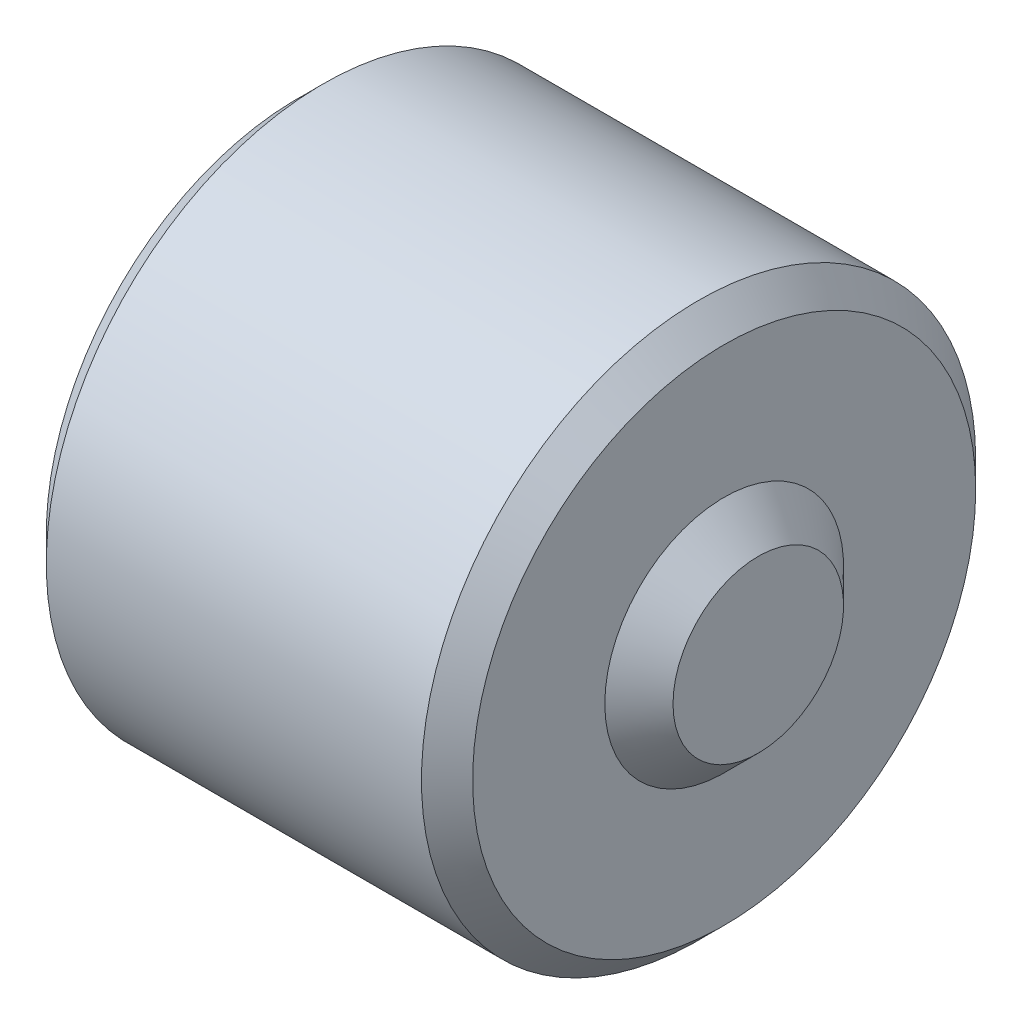
ISO-10303-21;
HEADER;
FILE_DESCRIPTION(('STEP AP214'),'2;1');
FILE_NAME('part.step','',(''),(''),'','','');
FILE_SCHEMA(('AUTOMOTIVE_DESIGN { 1 0 10303 214 1 1 1 1 }'));
ENDSEC;
DATA;
#1=APPLICATION_CONTEXT('core data for automotive mechanical design processes');
#2=APPLICATION_PROTOCOL_DEFINITION('international standard','automotive_design',2000,#1);
#3=PRODUCT_CONTEXT('',#1,'mechanical');
#4=PRODUCT('Part','Part','',(#3));
#5=PRODUCT_RELATED_PRODUCT_CATEGORY('part','',(#4));
#6=PRODUCT_DEFINITION_FORMATION('','',#4);
#7=PRODUCT_DEFINITION_CONTEXT('part definition',#1,'design');
#8=PRODUCT_DEFINITION('design','',#6,#7);
#9=PRODUCT_DEFINITION_SHAPE('','',#8);
#10=(LENGTH_UNIT() NAMED_UNIT(*) SI_UNIT(.MILLI.,.METRE.));
#11=(NAMED_UNIT(*) PLANE_ANGLE_UNIT() SI_UNIT($,.RADIAN.));
#12=(NAMED_UNIT(*) SI_UNIT($,.STERADIAN.) SOLID_ANGLE_UNIT());
#13=UNCERTAINTY_MEASURE_WITH_UNIT(LENGTH_MEASURE(1.E-05),#10,'distance_accuracy_value','');
#14=(GEOMETRIC_REPRESENTATION_CONTEXT(3) GLOBAL_UNCERTAINTY_ASSIGNED_CONTEXT((#13)) GLOBAL_UNIT_ASSIGNED_CONTEXT((#10,
#11,#12)) REPRESENTATION_CONTEXT('',''));
#15=CARTESIAN_POINT('',(0.,0.,0.));
#16=DIRECTION('',(0.,0.,1.));
#17=DIRECTION('',(1.,0.,0.));
#18=AXIS2_PLACEMENT_3D('',#15,#16,#17);
#19=CARTESIAN_POINT('',(-12.7,0.,0.));
#20=DIRECTION('',(1.,0.,0.));
#21=DIRECTION('',(0.,0.,-1.));
#22=AXIS2_PLACEMENT_3D('',#19,#20,#21);
#23=CYLINDRICAL_SURFACE('',#22,8.255);
#24=CARTESIAN_POINT('',(-11.938,0.,0.));
#25=DIRECTION('',(1.,0.,0.));
#26=DIRECTION('',(0.,0.,-1.));
#27=AXIS2_PLACEMENT_3D('',#24,#25,#26);
#28=CIRCLE('',#27,8.255);
#29=CARTESIAN_POINT('',(-11.938,0.,-8.255));
#30=VERTEX_POINT('',#29);
#31=EDGE_CURVE('E67',#30,#30,#28,.T.);
#32=ORIENTED_EDGE('',*,*,#31,.T.);
#33=EDGE_LOOP('',(#32));
#34=FACE_BOUND('',#33,.T.);
#35=CARTESIAN_POINT('',(-0.762000000000002,0.,0.));
#36=DIRECTION('',(1.,0.,0.));
#37=DIRECTION('',(0.,0.,-1.));
#38=AXIS2_PLACEMENT_3D('',#35,#36,#37);
#39=CIRCLE('',#38,8.255);
#40=CARTESIAN_POINT('',(-0.762000000000002,0.,-8.255));
#41=VERTEX_POINT('',#40);
#42=EDGE_CURVE('E73',#41,#41,#39,.F.);
#43=ORIENTED_EDGE('',*,*,#42,.T.);
#44=EDGE_LOOP('',(#43));
#45=FACE_BOUND('',#44,.T.);
#46=ADVANCED_FACE('F52',(#34,#45),#23,.T.);
#47=CARTESIAN_POINT('',(-12.7,0.,0.));
#48=DIRECTION('',(1.,0.,0.));
#49=DIRECTION('',(0.,0.,-1.));
#50=AXIS2_PLACEMENT_3D('',#47,#48,#49);
#51=PLANE('',#50);
#52=CARTESIAN_POINT('',(-12.7,0.,0.));
#53=DIRECTION('',(1.,0.,0.));
#54=DIRECTION('',(0.,0.,-1.));
#55=AXIS2_PLACEMENT_3D('',#52,#53,#54);
#56=CIRCLE('',#55,7.49299999999999);
#57=CARTESIAN_POINT('',(-12.7,0.,-7.49299999999999));
#58=VERTEX_POINT('',#57);
#59=EDGE_CURVE('E61',#58,#58,#56,.F.);
#60=ORIENTED_EDGE('',*,*,#59,.T.);
#61=EDGE_LOOP('',(#60));
#62=FACE_BOUND('',#61,.T.);
#63=CARTESIAN_POINT('',(-12.7,0.,0.));
#64=DIRECTION('',(-1.,0.,0.));
#65=DIRECTION('',(0.,0.,1.));
#66=AXIS2_PLACEMENT_3D('',#63,#64,#65);
#67=CIRCLE('',#66,5.715);
#68=CARTESIAN_POINT('',(-12.7,0.,5.715));
#69=VERTEX_POINT('',#68);
#70=EDGE_CURVE('E80',#69,#69,#67,.T.);
#71=ORIENTED_EDGE('',*,*,#70,.F.);
#72=EDGE_LOOP('',(#71));
#73=FACE_BOUND('',#72,.T.);
#74=ADVANCED_FACE('F115',(#62,#73),#51,.F.);
#75=CARTESIAN_POINT('',(0.,0.,0.));
#76=DIRECTION('',(1.,0.,0.));
#77=DIRECTION('',(0.,0.,-1.));
#78=AXIS2_PLACEMENT_3D('',#75,#76,#77);
#79=PLANE('',#78);
#80=CARTESIAN_POINT('',(0.,0.,0.));
#81=DIRECTION('',(-1.,0.,0.));
#82=DIRECTION('',(0.,0.,1.));
#83=AXIS2_PLACEMENT_3D('',#80,#81,#82);
#84=CIRCLE('',#83,3.55600000000001);
#85=CARTESIAN_POINT('',(0.,0.,3.55600000000001));
#86=VERTEX_POINT('',#85);
#87=EDGE_CURVE('E91',#86,#86,#84,.T.);
#88=ORIENTED_EDGE('',*,*,#87,.T.);
#89=EDGE_LOOP('',(#88));
#90=FACE_BOUND('',#89,.T.);
#91=CARTESIAN_POINT('',(0.,0.,0.));
#92=DIRECTION('',(1.,0.,0.));
#93=DIRECTION('',(0.,0.,-1.));
#94=AXIS2_PLACEMENT_3D('',#91,#92,#93);
#95=CIRCLE('',#94,7.493);
#96=CARTESIAN_POINT('',(0.,0.,-7.493));
#97=VERTEX_POINT('',#96);
#98=EDGE_CURVE('E12',#97,#97,#95,.T.);
#99=ORIENTED_EDGE('',*,*,#98,.T.);
#100=EDGE_LOOP('',(#99));
#101=FACE_BOUND('',#100,.T.);
#102=ADVANCED_FACE('F97',(#90,#101),#79,.T.);
#103=CARTESIAN_POINT('',(-2.54,0.,0.));
#104=DIRECTION('',(-1.,0.,0.));
#105=DIRECTION('',(0.,0.,1.));
#106=AXIS2_PLACEMENT_3D('',#103,#104,#105);
#107=CYLINDRICAL_SURFACE('',#106,5.715);
#108=CARTESIAN_POINT('',(-2.54,0.,0.));
#109=DIRECTION('',(-1.,0.,0.));
#110=DIRECTION('',(0.,0.,1.));
#111=AXIS2_PLACEMENT_3D('',#108,#109,#110);
#112=CIRCLE('',#111,5.715);
#113=CARTESIAN_POINT('',(-2.54,0.,5.715));
#114=VERTEX_POINT('',#113);
#115=EDGE_CURVE('E79',#114,#114,#112,.T.);
#116=ORIENTED_EDGE('',*,*,#115,.F.);
#117=EDGE_LOOP('',(#116));
#118=FACE_BOUND('',#117,.T.);
#119=ORIENTED_EDGE('',*,*,#70,.T.);
#120=EDGE_LOOP('',(#119));
#121=FACE_BOUND('',#120,.T.);
#122=ADVANCED_FACE('F133',(#118,#121),#107,.F.);
#123=CARTESIAN_POINT('',(-2.54,0.,0.));
#124=DIRECTION('',(-1.,0.,0.));
#125=DIRECTION('',(0.,0.,1.));
#126=AXIS2_PLACEMENT_3D('',#123,#124,#125);
#127=PLANE('',#126);
#128=ORIENTED_EDGE('',*,*,#115,.T.);
#129=EDGE_LOOP('',(#128));
#130=FACE_BOUND('',#129,.T.);
#131=ADVANCED_FACE('F128',(#130),#127,.T.);
#132=CARTESIAN_POINT('',(-11.938,0.,0.));
#133=DIRECTION('',(1.,0.,0.));
#134=DIRECTION('',(0.,0.,-1.));
#135=AXIS2_PLACEMENT_3D('',#132,#133,#134);
#136=CONICAL_SURFACE('',#135,8.255,0.78539816339745);
#137=ORIENTED_EDGE('',*,*,#59,.F.);
#138=EDGE_LOOP('',(#137));
#139=FACE_BOUND('',#138,.T.);
#140=ORIENTED_EDGE('',*,*,#31,.F.);
#141=EDGE_LOOP('',(#140));
#142=FACE_BOUND('',#141,.T.);
#143=ADVANCED_FACE('F111',(#139,#142),#136,.T.);
#144=CARTESIAN_POINT('',(0.,0.,0.));
#145=DIRECTION('',(-1.,0.,0.));
#146=DIRECTION('',(0.,0.,1.));
#147=AXIS2_PLACEMENT_3D('',#144,#145,#146);
#148=CONICAL_SURFACE('',#147,7.493,0.785398163397445);
#149=ORIENTED_EDGE('',*,*,#42,.F.);
#150=EDGE_LOOP('',(#149));
#151=FACE_BOUND('',#150,.T.);
#152=ORIENTED_EDGE('',*,*,#98,.F.);
#153=EDGE_LOOP('',(#152));
#154=FACE_BOUND('',#153,.T.);
#155=ADVANCED_FACE('F55',(#151,#154),#148,.T.);
#156=CARTESIAN_POINT('',(1.016,0.,0.));
#157=DIRECTION('',(-1.,0.,0.));
#158=DIRECTION('',(0.,0.,1.));
#159=AXIS2_PLACEMENT_3D('',#156,#157,#158);
#160=PLANE('',#159);
#161=CARTESIAN_POINT('',(1.016,0.,0.));
#162=DIRECTION('',(-1.,0.,0.));
#163=DIRECTION('',(0.,0.,1.));
#164=AXIS2_PLACEMENT_3D('',#161,#162,#163);
#165=CIRCLE('',#164,2.54);
#166=CARTESIAN_POINT('',(1.016,0.,2.54));
#167=VERTEX_POINT('',#166);
#168=EDGE_CURVE('E84',#167,#167,#165,.T.);
#169=ORIENTED_EDGE('',*,*,#168,.F.);
#170=EDGE_LOOP('',(#169));
#171=FACE_BOUND('',#170,.T.);
#172=ADVANCED_FACE('F102',(#171),#160,.F.);
#173=CARTESIAN_POINT('',(1.016,0.,0.));
#174=DIRECTION('',(-1.,0.,0.));
#175=DIRECTION('',(0.,0.,1.));
#176=AXIS2_PLACEMENT_3D('',#173,#174,#175);
#177=CONICAL_SURFACE('',#176,2.54,0.785398163397454);
#178=ORIENTED_EDGE('',*,*,#87,.F.);
#179=EDGE_LOOP('',(#178));
#180=FACE_BOUND('',#179,.T.);
#181=ORIENTED_EDGE('',*,*,#168,.T.);
#182=EDGE_LOOP('',(#181));
#183=FACE_BOUND('',#182,.T.);
#184=ADVANCED_FACE('F99',(#180,#183),#177,.T.);
#185=CLOSED_SHELL('',(#46,#74,#102,#122,#131,#143,#155,#172,#184));
#186=MANIFOLD_SOLID_BREP('B2',#185);
#187=ADVANCED_BREP_SHAPE_REPRESENTATION('',(#18,#186),#14);
#188=SHAPE_DEFINITION_REPRESENTATION(#9,#187);
ENDSEC;
END-ISO-10303-21;
